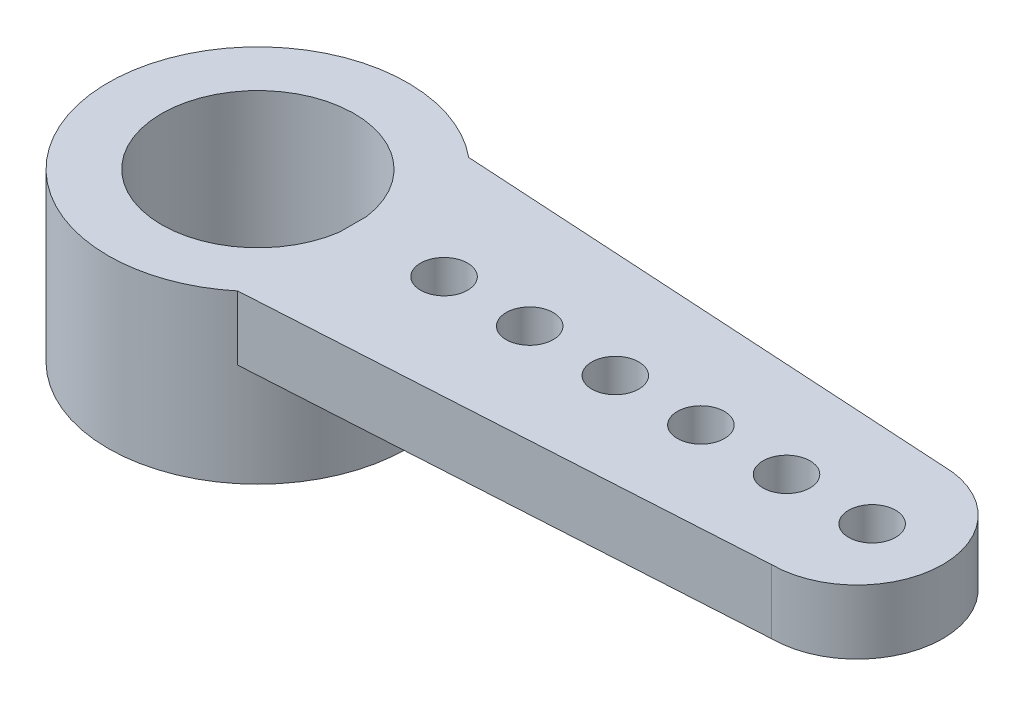
ISO-10303-21;
HEADER;
FILE_DESCRIPTION(('STEP AP214'),'2;1');
FILE_NAME('part.step','',(''),(''),'','','');
FILE_SCHEMA(('AUTOMOTIVE_DESIGN { 1 0 10303 214 1 1 1 1 }'));
ENDSEC;
DATA;
#1=APPLICATION_CONTEXT('core data for automotive mechanical design processes');
#2=APPLICATION_PROTOCOL_DEFINITION('international standard','automotive_design',2000,#1);
#3=PRODUCT_CONTEXT('',#1,'mechanical');
#4=PRODUCT('Part','Part','',(#3));
#5=PRODUCT_RELATED_PRODUCT_CATEGORY('part','',(#4));
#6=PRODUCT_DEFINITION_FORMATION('','',#4);
#7=PRODUCT_DEFINITION_CONTEXT('part definition',#1,'design');
#8=PRODUCT_DEFINITION('design','',#6,#7);
#9=PRODUCT_DEFINITION_SHAPE('','',#8);
#10=(LENGTH_UNIT() NAMED_UNIT(*) SI_UNIT(.MILLI.,.METRE.));
#11=(NAMED_UNIT(*) PLANE_ANGLE_UNIT() SI_UNIT($,.RADIAN.));
#12=(NAMED_UNIT(*) SI_UNIT($,.STERADIAN.) SOLID_ANGLE_UNIT());
#13=UNCERTAINTY_MEASURE_WITH_UNIT(LENGTH_MEASURE(1.E-05),#10,'distance_accuracy_value','');
#14=(GEOMETRIC_REPRESENTATION_CONTEXT(3) GLOBAL_UNCERTAINTY_ASSIGNED_CONTEXT((#13)) GLOBAL_UNIT_ASSIGNED_CONTEXT((#10,
#11,#12)) REPRESENTATION_CONTEXT('',''));
#15=CARTESIAN_POINT('',(0.,0.,0.));
#16=DIRECTION('',(0.,0.,1.));
#17=DIRECTION('',(1.,0.,0.));
#18=AXIS2_PLACEMENT_3D('',#15,#16,#17);
#19=CARTESIAN_POINT('',(4.35,-1.5,0.));
#20=DIRECTION('',(0.,1.,0.));
#21=DIRECTION('',(0.,0.,1.));
#22=AXIS2_PLACEMENT_3D('',#19,#20,#21);
#23=CYLINDRICAL_SURFACE('',#22,0.55);
#24=CARTESIAN_POINT('',(4.35,-1.5,0.));
#25=DIRECTION('',(0.,1.,0.));
#26=DIRECTION('',(0.,0.,1.));
#27=AXIS2_PLACEMENT_3D('',#24,#25,#26);
#28=CIRCLE('',#27,0.55);
#29=CARTESIAN_POINT('',(4.35,-1.5,0.55));
#30=VERTEX_POINT('',#29);
#31=EDGE_CURVE('E41',#30,#30,#28,.T.);
#32=ORIENTED_EDGE('',*,*,#31,.F.);
#33=EDGE_LOOP('',(#32));
#34=FACE_BOUND('',#33,.T.);
#35=CARTESIAN_POINT('',(4.35,0.,0.));
#36=DIRECTION('',(0.,1.,0.));
#37=DIRECTION('',(0.,0.,1.));
#38=AXIS2_PLACEMENT_3D('',#35,#36,#37);
#39=CIRCLE('',#38,0.55);
#40=CARTESIAN_POINT('',(4.35,0.,0.55));
#41=VERTEX_POINT('',#40);
#42=EDGE_CURVE('E11',#41,#41,#39,.T.);
#43=ORIENTED_EDGE('',*,*,#42,.T.);
#44=EDGE_LOOP('',(#43));
#45=FACE_BOUND('',#44,.T.);
#46=ADVANCED_FACE('F34',(#34,#45),#23,.F.);
#47=CARTESIAN_POINT('',(6.35,-1.5,0.));
#48=DIRECTION('',(0.,1.,0.));
#49=DIRECTION('',(0.,0.,1.));
#50=AXIS2_PLACEMENT_3D('',#47,#48,#49);
#51=CYLINDRICAL_SURFACE('',#50,0.55);
#52=CARTESIAN_POINT('',(6.35,-1.5,0.));
#53=DIRECTION('',(0.,1.,0.));
#54=DIRECTION('',(0.,0.,1.));
#55=AXIS2_PLACEMENT_3D('',#52,#53,#54);
#56=CIRCLE('',#55,0.55);
#57=CARTESIAN_POINT('',(6.35,-1.5,0.55));
#58=VERTEX_POINT('',#57);
#59=EDGE_CURVE('E162',#58,#58,#56,.T.);
#60=ORIENTED_EDGE('',*,*,#59,.F.);
#61=EDGE_LOOP('',(#60));
#62=FACE_BOUND('',#61,.T.);
#63=CARTESIAN_POINT('',(6.35,0.,0.));
#64=DIRECTION('',(0.,1.,0.));
#65=DIRECTION('',(0.,0.,1.));
#66=AXIS2_PLACEMENT_3D('',#63,#64,#65);
#67=CIRCLE('',#66,0.55);
#68=CARTESIAN_POINT('',(6.35,0.,0.55));
#69=VERTEX_POINT('',#68);
#70=EDGE_CURVE('E165',#69,#69,#67,.T.);
#71=ORIENTED_EDGE('',*,*,#70,.T.);
#72=EDGE_LOOP('',(#71));
#73=FACE_BOUND('',#72,.T.);
#74=ADVANCED_FACE('F173',(#62,#73),#51,.F.);
#75=CARTESIAN_POINT('',(8.35,-1.5,0.));
#76=DIRECTION('',(0.,1.,0.));
#77=DIRECTION('',(0.,0.,1.));
#78=AXIS2_PLACEMENT_3D('',#75,#76,#77);
#79=CYLINDRICAL_SURFACE('',#78,0.55);
#80=CARTESIAN_POINT('',(8.35,-1.5,0.));
#81=DIRECTION('',(0.,1.,0.));
#82=DIRECTION('',(0.,0.,1.));
#83=AXIS2_PLACEMENT_3D('',#80,#81,#82);
#84=CIRCLE('',#83,0.55);
#85=CARTESIAN_POINT('',(8.35,-1.5,0.55));
#86=VERTEX_POINT('',#85);
#87=EDGE_CURVE('E156',#86,#86,#84,.T.);
#88=ORIENTED_EDGE('',*,*,#87,.F.);
#89=EDGE_LOOP('',(#88));
#90=FACE_BOUND('',#89,.T.);
#91=CARTESIAN_POINT('',(8.35,0.,0.));
#92=DIRECTION('',(0.,1.,0.));
#93=DIRECTION('',(0.,0.,1.));
#94=AXIS2_PLACEMENT_3D('',#91,#92,#93);
#95=CIRCLE('',#94,0.55);
#96=CARTESIAN_POINT('',(8.35,0.,0.55));
#97=VERTEX_POINT('',#96);
#98=EDGE_CURVE('E159',#97,#97,#95,.T.);
#99=ORIENTED_EDGE('',*,*,#98,.T.);
#100=EDGE_LOOP('',(#99));
#101=FACE_BOUND('',#100,.T.);
#102=ADVANCED_FACE('F200',(#90,#101),#79,.F.);
#103=CARTESIAN_POINT('',(10.35,-1.5,0.));
#104=DIRECTION('',(0.,1.,0.));
#105=DIRECTION('',(0.,0.,1.));
#106=AXIS2_PLACEMENT_3D('',#103,#104,#105);
#107=CYLINDRICAL_SURFACE('',#106,0.55);
#108=CARTESIAN_POINT('',(10.35,-1.5,0.));
#109=DIRECTION('',(0.,1.,0.));
#110=DIRECTION('',(0.,0.,1.));
#111=AXIS2_PLACEMENT_3D('',#108,#109,#110);
#112=CIRCLE('',#111,0.55);
#113=CARTESIAN_POINT('',(10.35,-1.5,0.55));
#114=VERTEX_POINT('',#113);
#115=EDGE_CURVE('E150',#114,#114,#112,.T.);
#116=ORIENTED_EDGE('',*,*,#115,.F.);
#117=EDGE_LOOP('',(#116));
#118=FACE_BOUND('',#117,.T.);
#119=CARTESIAN_POINT('',(10.35,0.,0.));
#120=DIRECTION('',(0.,1.,0.));
#121=DIRECTION('',(0.,0.,1.));
#122=AXIS2_PLACEMENT_3D('',#119,#120,#121);
#123=CIRCLE('',#122,0.55);
#124=CARTESIAN_POINT('',(10.35,0.,0.55));
#125=VERTEX_POINT('',#124);
#126=EDGE_CURVE('E153',#125,#125,#123,.T.);
#127=ORIENTED_EDGE('',*,*,#126,.T.);
#128=EDGE_LOOP('',(#127));
#129=FACE_BOUND('',#128,.T.);
#130=ADVANCED_FACE('F196',(#118,#129),#107,.F.);
#131=CARTESIAN_POINT('',(0.,-3.9,0.));
#132=DIRECTION('',(0.,1.,0.));
#133=DIRECTION('',(0.,0.,1.));
#134=AXIS2_PLACEMENT_3D('',#131,#132,#133);
#135=CYLINDRICAL_SURFACE('',#134,3.5);
#136=DIRECTION('',(0.,1.,0.));
#137=VECTOR('',#136,1.);
#138=CARTESIAN_POINT('',(2.22710574513201,-1.5,2.7));
#139=LINE('',#138,#137);
#140=CARTESIAN_POINT('',(2.22710574513201,-1.5,2.7));
#141=VERTEX_POINT('',#140);
#142=CARTESIAN_POINT('',(2.22710574513201,0.,2.7));
#143=VERTEX_POINT('',#142);
#144=EDGE_CURVE('E111',#141,#143,#139,.T.);
#145=ORIENTED_EDGE('',*,*,#144,.T.);
#146=CARTESIAN_POINT('',(0.,0.,0.));
#147=DIRECTION('',(0.,1.,0.));
#148=DIRECTION('',(0.,0.,1.));
#149=AXIS2_PLACEMENT_3D('',#146,#147,#148);
#150=CIRCLE('',#149,3.5);
#151=CARTESIAN_POINT('',(2.22710574513201,0.,-2.7));
#152=VERTEX_POINT('',#151);
#153=EDGE_CURVE('E138',#152,#143,#150,.T.);
#154=ORIENTED_EDGE('',*,*,#153,.F.);
#155=DIRECTION('',(0.,1.,0.));
#156=VECTOR('',#155,1.);
#157=CARTESIAN_POINT('',(2.22710574513201,-1.5,-2.7));
#158=LINE('',#157,#156);
#159=CARTESIAN_POINT('',(2.22710574513201,-1.5,-2.7));
#160=VERTEX_POINT('',#159);
#161=EDGE_CURVE('E130',#160,#152,#158,.T.);
#162=ORIENTED_EDGE('',*,*,#161,.F.);
#163=CARTESIAN_POINT('',(0.,-1.5,0.));
#164=DIRECTION('',(0.,1.,0.));
#165=DIRECTION('',(0.,0.,1.));
#166=AXIS2_PLACEMENT_3D('',#163,#164,#165);
#167=CIRCLE('',#166,3.5);
#168=EDGE_CURVE('E129',#160,#141,#167,.F.);
#169=ORIENTED_EDGE('',*,*,#168,.T.);
#170=EDGE_LOOP('',(#145,#154,#162,#169));
#171=FACE_BOUND('',#170,.T.);
#172=CARTESIAN_POINT('',(0.,-3.9,0.));
#173=DIRECTION('',(0.,1.,0.));
#174=DIRECTION('',(0.,0.,1.));
#175=AXIS2_PLACEMENT_3D('',#172,#173,#174);
#176=CIRCLE('',#175,3.5);
#177=CARTESIAN_POINT('',(0.,-3.9,3.5));
#178=VERTEX_POINT('',#177);
#179=EDGE_CURVE('E140',#178,#178,#176,.T.);
#180=ORIENTED_EDGE('',*,*,#179,.T.);
#181=EDGE_LOOP('',(#180));
#182=FACE_BOUND('',#181,.T.);
#183=ADVANCED_FACE('F188',(#171,#182),#135,.T.);
#184=CARTESIAN_POINT('',(0.,-3.9,0.));
#185=DIRECTION('',(0.,1.,0.));
#186=DIRECTION('',(0.,0.,1.));
#187=AXIS2_PLACEMENT_3D('',#184,#185,#186);
#188=PLANE('',#187);
#189=CARTESIAN_POINT('',(0.,-3.9,0.));
#190=DIRECTION('',(0.,1.,0.));
#191=DIRECTION('',(0.,0.,1.));
#192=AXIS2_PLACEMENT_3D('',#189,#190,#191);
#193=CIRCLE('',#192,2.25);
#194=CARTESIAN_POINT('',(0.,-3.9,2.25));
#195=VERTEX_POINT('',#194);
#196=EDGE_CURVE('E135',#195,#195,#193,.T.);
#197=ORIENTED_EDGE('',*,*,#196,.T.);
#198=EDGE_LOOP('',(#197));
#199=FACE_BOUND('',#198,.T.);
#200=ORIENTED_EDGE('',*,*,#179,.F.);
#201=EDGE_LOOP('',(#200));
#202=FACE_BOUND('',#201,.T.);
#203=ADVANCED_FACE('F179',(#199,#202),#188,.F.);
#204=CARTESIAN_POINT('',(0.,0.,0.));
#205=DIRECTION('',(0.,1.,0.));
#206=DIRECTION('',(0.,0.,1.));
#207=AXIS2_PLACEMENT_3D('',#204,#205,#206);
#208=PLANE('',#207);
#209=CARTESIAN_POINT('',(12.35,0.,0.));
#210=DIRECTION('',(0.,1.,0.));
#211=DIRECTION('',(0.,0.,1.));
#212=AXIS2_PLACEMENT_3D('',#209,#210,#211);
#213=CIRCLE('',#212,0.55);
#214=CARTESIAN_POINT('',(12.35,0.,0.55));
#215=VERTEX_POINT('',#214);
#216=EDGE_CURVE('E362',#215,#215,#213,.T.);
#217=ORIENTED_EDGE('',*,*,#216,.F.);
#218=EDGE_LOOP('',(#217));
#219=FACE_BOUND('',#218,.T.);
#220=CARTESIAN_POINT('',(14.35,0.,0.));
#221=DIRECTION('',(0.,1.,0.));
#222=DIRECTION('',(0.,0.,1.));
#223=AXIS2_PLACEMENT_3D('',#220,#221,#222);
#224=CIRCLE('',#223,0.55);
#225=CARTESIAN_POINT('',(14.35,0.,0.55));
#226=VERTEX_POINT('',#225);
#227=EDGE_CURVE('E117',#226,#226,#224,.T.);
#228=ORIENTED_EDGE('',*,*,#227,.F.);
#229=EDGE_LOOP('',(#228));
#230=FACE_BOUND('',#229,.T.);
#231=CARTESIAN_POINT('',(0.,0.,0.));
#232=DIRECTION('',(0.,1.,0.));
#233=DIRECTION('',(0.,0.,1.));
#234=AXIS2_PLACEMENT_3D('',#231,#232,#233);
#235=CIRCLE('',#234,2.25);
#236=CARTESIAN_POINT('',(2.22710574513201,0.,-0.320156211871636));
#237=VERTEX_POINT('',#236);
#238=CARTESIAN_POINT('',(2.22710574513201,0.,0.320156211871636));
#239=VERTEX_POINT('',#238);
#240=EDGE_CURVE('E134',#237,#239,#235,.T.);
#241=ORIENTED_EDGE('',*,*,#240,.F.);
#242=DIRECTION('',(0.,0.,1.));
#243=VECTOR('',#242,1.);
#244=CARTESIAN_POINT('',(2.22710574513201,0.,0.));
#245=LINE('',#244,#243);
#246=EDGE_CURVE('E112',#237,#239,#245,.T.);
#247=ORIENTED_EDGE('',*,*,#246,.T.);
#248=EDGE_LOOP('',(#241,#247));
#249=FACE_BOUND('',#248,.T.);
#250=ORIENTED_EDGE('',*,*,#153,.T.);
#251=DIRECTION('',(0.998237009670938,0.,-0.0593537911444947));
#252=VECTOR('',#251,1.);
#253=CARTESIAN_POINT('',(0.167818517294568,0.,2.82244236873954));
#254=LINE('',#253,#252);
#255=CARTESIAN_POINT('',(14.,0.,2.));
#256=VERTEX_POINT('',#255);
#257=EDGE_CURVE('E123',#143,#256,#254,.T.);
#258=ORIENTED_EDGE('',*,*,#257,.T.);
#259=CARTESIAN_POINT('',(14.,0.,0.));
#260=DIRECTION('',(0.,1.,0.));
#261=DIRECTION('',(0.,0.,1.));
#262=AXIS2_PLACEMENT_3D('',#259,#260,#261);
#263=CIRCLE('',#262,2.);
#264=CARTESIAN_POINT('',(14.,0.,-2.));
#265=VERTEX_POINT('',#264);
#266=EDGE_CURVE('E92',#256,#265,#263,.T.);
#267=ORIENTED_EDGE('',*,*,#266,.T.);
#268=DIRECTION('',(-0.998237009670938,0.,-0.0593537911444947));
#269=VECTOR('',#268,1.);
#270=CARTESIAN_POINT('',(0.167818517294568,0.,-2.82244236873954));
#271=LINE('',#270,#269);
#272=EDGE_CURVE('E48',#265,#152,#271,.T.);
#273=ORIENTED_EDGE('',*,*,#272,.T.);
#274=EDGE_LOOP('',(#250,#258,#267,#273));
#275=FACE_BOUND('',#274,.T.);
#276=ORIENTED_EDGE('',*,*,#126,.F.);
#277=EDGE_LOOP('',(#276));
#278=FACE_BOUND('',#277,.T.);
#279=ORIENTED_EDGE('',*,*,#98,.F.);
#280=EDGE_LOOP('',(#279));
#281=FACE_BOUND('',#280,.T.);
#282=ORIENTED_EDGE('',*,*,#70,.F.);
#283=EDGE_LOOP('',(#282));
#284=FACE_BOUND('',#283,.T.);
#285=ORIENTED_EDGE('',*,*,#42,.F.);
#286=EDGE_LOOP('',(#285));
#287=FACE_BOUND('',#286,.T.);
#288=ADVANCED_FACE('F176',(#219,#230,#249,#275,#278,#281,#284,#287),#208,.T.);
#289=CARTESIAN_POINT('',(0.,-3.9,0.));
#290=DIRECTION('',(0.,1.,0.));
#291=DIRECTION('',(0.,0.,1.));
#292=AXIS2_PLACEMENT_3D('',#289,#290,#291);
#293=CYLINDRICAL_SURFACE('',#292,2.25);
#294=ORIENTED_EDGE('',*,*,#240,.T.);
#295=DIRECTION('',(0.,1.,0.));
#296=VECTOR('',#295,1.);
#297=CARTESIAN_POINT('',(2.22710574513201,-3.9,0.320156211871636));
#298=LINE('',#297,#296);
#299=CARTESIAN_POINT('',(2.22710574513201,-1.5,0.320156211871636));
#300=VERTEX_POINT('',#299);
#301=EDGE_CURVE('E56',#239,#300,#298,.F.);
#302=ORIENTED_EDGE('',*,*,#301,.T.);
#303=CARTESIAN_POINT('',(0.,-1.5,0.));
#304=DIRECTION('',(0.,1.,0.));
#305=DIRECTION('',(0.,0.,1.));
#306=AXIS2_PLACEMENT_3D('',#303,#304,#305);
#307=CIRCLE('',#306,2.25);
#308=CARTESIAN_POINT('',(2.22710574513201,-1.5,-0.320156211871636));
#309=VERTEX_POINT('',#308);
#310=EDGE_CURVE('E143',#309,#300,#307,.F.);
#311=ORIENTED_EDGE('',*,*,#310,.F.);
#312=DIRECTION('',(0.,1.,0.));
#313=VECTOR('',#312,1.);
#314=CARTESIAN_POINT('',(2.22710574513201,-3.9,-0.320156211871636));
#315=LINE('',#314,#313);
#316=EDGE_CURVE('E146',#309,#237,#315,.T.);
#317=ORIENTED_EDGE('',*,*,#316,.T.);
#318=EDGE_LOOP('',(#294,#302,#311,#317));
#319=FACE_BOUND('',#318,.T.);
#320=ORIENTED_EDGE('',*,*,#196,.F.);
#321=EDGE_LOOP('',(#320));
#322=FACE_BOUND('',#321,.T.);
#323=ADVANCED_FACE('F178',(#319,#322),#293,.F.);
#324=CARTESIAN_POINT('',(0.,-1.5,0.));
#325=DIRECTION('',(0.,1.,0.));
#326=DIRECTION('',(0.,0.,1.));
#327=AXIS2_PLACEMENT_3D('',#324,#325,#326);
#328=PLANE('',#327);
#329=DIRECTION('',(0.,0.,1.));
#330=VECTOR('',#329,1.);
#331=CARTESIAN_POINT('',(2.22710574513201,-1.5,0.));
#332=LINE('',#331,#330);
#333=EDGE_CURVE('E97',#309,#300,#332,.T.);
#334=ORIENTED_EDGE('',*,*,#333,.F.);
#335=ORIENTED_EDGE('',*,*,#310,.T.);
#336=EDGE_LOOP('',(#334,#335));
#337=FACE_BOUND('',#336,.T.);
#338=ADVANCED_FACE('F186',(#337),#328,.F.);
#339=CARTESIAN_POINT('',(2.22710574513201,-1.5,0.));
#340=DIRECTION('',(-1.,0.,0.));
#341=DIRECTION('',(0.,0.,1.));
#342=AXIS2_PLACEMENT_3D('',#339,#340,#341);
#343=PLANE('',#342);
#344=ORIENTED_EDGE('',*,*,#301,.F.);
#345=ORIENTED_EDGE('',*,*,#246,.F.);
#346=ORIENTED_EDGE('',*,*,#316,.F.);
#347=ORIENTED_EDGE('',*,*,#333,.T.);
#348=EDGE_LOOP('',(#344,#345,#346,#347));
#349=FACE_BOUND('',#348,.T.);
#350=ADVANCED_FACE('F230',(#349),#343,.T.);
#351=CARTESIAN_POINT('',(0.167818517294568,-1.5,2.82244236873954));
#352=DIRECTION('',(0.0593537911444947,0.,0.998237009670938));
#353=DIRECTION('',(0.998237009670938,0.,-0.0593537911444947));
#354=AXIS2_PLACEMENT_3D('',#351,#352,#353);
#355=PLANE('',#354);
#356=ORIENTED_EDGE('',*,*,#257,.F.);
#357=ORIENTED_EDGE('',*,*,#144,.F.);
#358=DIRECTION('',(0.998237009670938,0.,-0.0593537911444947));
#359=VECTOR('',#358,1.);
#360=CARTESIAN_POINT('',(0.167818517294568,-1.5,2.82244236873954));
#361=LINE('',#360,#359);
#362=CARTESIAN_POINT('',(14.,-1.5,2.));
#363=VERTEX_POINT('',#362);
#364=EDGE_CURVE('E104',#141,#363,#361,.T.);
#365=ORIENTED_EDGE('',*,*,#364,.T.);
#366=DIRECTION('',(0.,1.,0.));
#367=VECTOR('',#366,1.);
#368=CARTESIAN_POINT('',(14.,-1.5,2.));
#369=LINE('',#368,#367);
#370=EDGE_CURVE('E88',#363,#256,#369,.T.);
#371=ORIENTED_EDGE('',*,*,#370,.T.);
#372=EDGE_LOOP('',(#356,#357,#365,#371));
#373=FACE_BOUND('',#372,.T.);
#374=ADVANCED_FACE('F109',(#373),#355,.T.);
#375=CARTESIAN_POINT('',(0.167818517294568,-1.5,-2.82244236873954));
#376=DIRECTION('',(0.0593537911444947,0.,-0.998237009670938));
#377=DIRECTION('',(-0.998237009670938,0.,-0.0593537911444947));
#378=AXIS2_PLACEMENT_3D('',#375,#376,#377);
#379=PLANE('',#378);
#380=ORIENTED_EDGE('',*,*,#272,.F.);
#381=DIRECTION('',(0.,1.,0.));
#382=VECTOR('',#381,1.);
#383=CARTESIAN_POINT('',(14.,-1.5,-2.));
#384=LINE('',#383,#382);
#385=CARTESIAN_POINT('',(14.,-1.5,-2.));
#386=VERTEX_POINT('',#385);
#387=EDGE_CURVE('E96',#386,#265,#384,.T.);
#388=ORIENTED_EDGE('',*,*,#387,.F.);
#389=DIRECTION('',(-0.998237009670938,0.,-0.0593537911444947));
#390=VECTOR('',#389,1.);
#391=CARTESIAN_POINT('',(0.167818517294568,-1.5,-2.82244236873954));
#392=LINE('',#391,#390);
#393=EDGE_CURVE('E107',#386,#160,#392,.T.);
#394=ORIENTED_EDGE('',*,*,#393,.T.);
#395=ORIENTED_EDGE('',*,*,#161,.T.);
#396=EDGE_LOOP('',(#380,#388,#394,#395));
#397=FACE_BOUND('',#396,.T.);
#398=ADVANCED_FACE('F224',(#397),#379,.T.);
#399=CARTESIAN_POINT('',(14.,-1.5,0.));
#400=DIRECTION('',(0.,1.,0.));
#401=DIRECTION('',(0.,0.,1.));
#402=AXIS2_PLACEMENT_3D('',#399,#400,#401);
#403=CYLINDRICAL_SURFACE('',#402,2.);
#404=ORIENTED_EDGE('',*,*,#266,.F.);
#405=ORIENTED_EDGE('',*,*,#370,.F.);
#406=CARTESIAN_POINT('',(14.,-1.5,0.));
#407=DIRECTION('',(0.,1.,0.));
#408=DIRECTION('',(0.,0.,1.));
#409=AXIS2_PLACEMENT_3D('',#406,#407,#408);
#410=CIRCLE('',#409,2.);
#411=EDGE_CURVE('E91',#363,#386,#410,.T.);
#412=ORIENTED_EDGE('',*,*,#411,.T.);
#413=ORIENTED_EDGE('',*,*,#387,.T.);
#414=EDGE_LOOP('',(#404,#405,#412,#413));
#415=FACE_BOUND('',#414,.T.);
#416=ADVANCED_FACE('F90',(#415),#403,.T.);
#417=CARTESIAN_POINT('',(12.35,-1.5,0.));
#418=DIRECTION('',(0.,1.,0.));
#419=DIRECTION('',(0.,0.,1.));
#420=AXIS2_PLACEMENT_3D('',#417,#418,#419);
#421=CIRCLE('',#420,0.55);
#422=CARTESIAN_POINT('',(12.35,-1.5,0.55));
#423=VERTEX_POINT('',#422);
#424=EDGE_CURVE('E360',#423,#423,#421,.T.);
#425=ORIENTED_EDGE('',*,*,#424,.T.);
#426=EDGE_LOOP('',(#425));
#427=FACE_BOUND('',#426,.T.);
#428=CARTESIAN_POINT('',(14.35,-1.5,0.));
#429=DIRECTION('',(0.,1.,0.));
#430=DIRECTION('',(0.,0.,1.));
#431=AXIS2_PLACEMENT_3D('',#428,#429,#430);
#432=CIRCLE('',#431,0.55);
#433=CARTESIAN_POINT('',(14.35,-1.5,0.55));
#434=VERTEX_POINT('',#433);
#435=EDGE_CURVE('E125',#434,#434,#432,.T.);
#436=ORIENTED_EDGE('',*,*,#435,.T.);
#437=EDGE_LOOP('',(#436));
#438=FACE_BOUND('',#437,.T.);
#439=ORIENTED_EDGE('',*,*,#168,.F.);
#440=ORIENTED_EDGE('',*,*,#393,.F.);
#441=ORIENTED_EDGE('',*,*,#411,.F.);
#442=ORIENTED_EDGE('',*,*,#364,.F.);
#443=EDGE_LOOP('',(#439,#440,#441,#442));
#444=FACE_BOUND('',#443,.T.);
#445=ORIENTED_EDGE('',*,*,#115,.T.);
#446=EDGE_LOOP('',(#445));
#447=FACE_BOUND('',#446,.T.);
#448=ORIENTED_EDGE('',*,*,#87,.T.);
#449=EDGE_LOOP('',(#448));
#450=FACE_BOUND('',#449,.T.);
#451=ORIENTED_EDGE('',*,*,#59,.T.);
#452=EDGE_LOOP('',(#451));
#453=FACE_BOUND('',#452,.T.);
#454=ORIENTED_EDGE('',*,*,#31,.T.);
#455=EDGE_LOOP('',(#454));
#456=FACE_BOUND('',#455,.T.);
#457=ADVANCED_FACE('F102',(#427,#438,#444,#447,#450,#453,#456),#328,.F.);
#458=CARTESIAN_POINT('',(14.35,-1.5,0.));
#459=DIRECTION('',(0.,1.,0.));
#460=DIRECTION('',(0.,0.,1.));
#461=AXIS2_PLACEMENT_3D('',#458,#459,#460);
#462=CYLINDRICAL_SURFACE('',#461,0.55);
#463=ORIENTED_EDGE('',*,*,#435,.F.);
#464=EDGE_LOOP('',(#463));
#465=FACE_BOUND('',#464,.T.);
#466=ORIENTED_EDGE('',*,*,#227,.T.);
#467=EDGE_LOOP('',(#466));
#468=FACE_BOUND('',#467,.T.);
#469=ADVANCED_FACE('F214',(#465,#468),#462,.F.);
#470=CARTESIAN_POINT('',(12.35,-1.5,0.));
#471=DIRECTION('',(0.,1.,0.));
#472=DIRECTION('',(0.,0.,1.));
#473=AXIS2_PLACEMENT_3D('',#470,#471,#472);
#474=CYLINDRICAL_SURFACE('',#473,0.55);
#475=ORIENTED_EDGE('',*,*,#424,.F.);
#476=EDGE_LOOP('',(#475));
#477=FACE_BOUND('',#476,.T.);
#478=ORIENTED_EDGE('',*,*,#216,.T.);
#479=EDGE_LOOP('',(#478));
#480=FACE_BOUND('',#479,.T.);
#481=ADVANCED_FACE('F221',(#477,#480),#474,.F.);
#482=CLOSED_SHELL('',(#46,#74,#102,#130,#183,#203,#288,#323,#338,#350,#374,#398,#416,#457,#469,#481));
#483=MANIFOLD_SOLID_BREP('B2',#482);
#484=ADVANCED_BREP_SHAPE_REPRESENTATION('',(#18,#483),#14);
#485=SHAPE_DEFINITION_REPRESENTATION(#9,#484);
ENDSEC;
END-ISO-10303-21;
